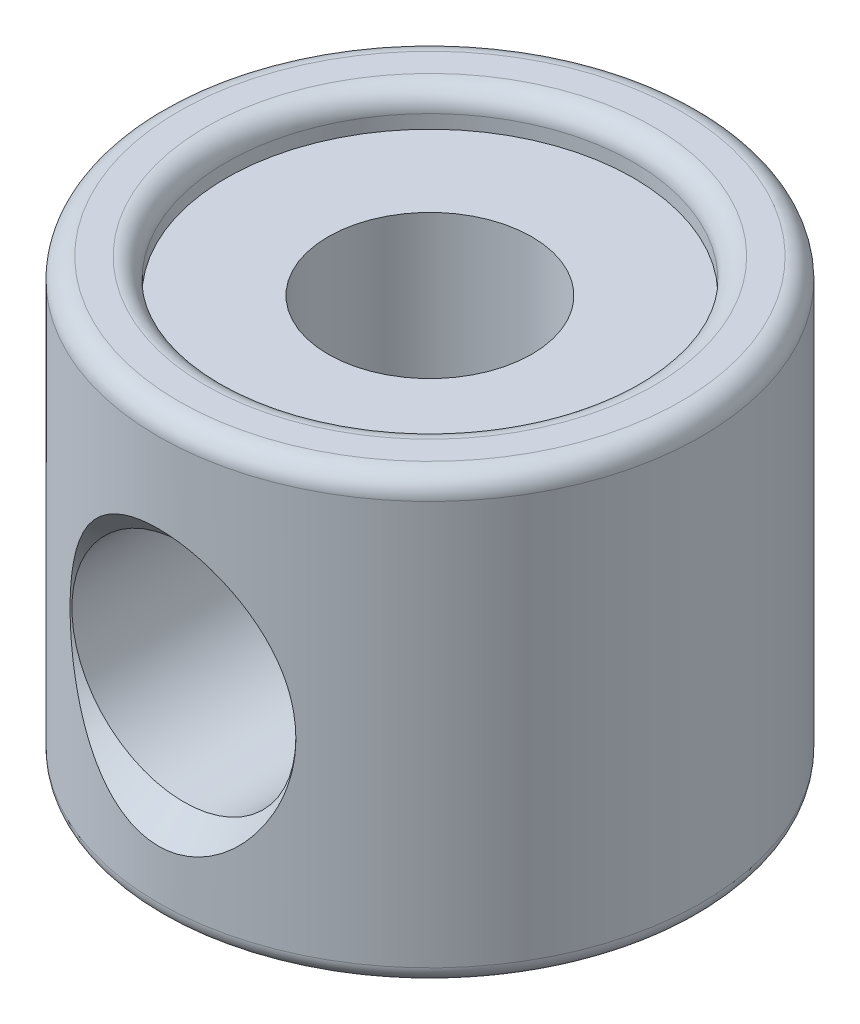
ISO-10303-21;
HEADER;
FILE_DESCRIPTION(('STEP AP214'),'2;1');
FILE_NAME('part.step','',(''),(''),'','','');
FILE_SCHEMA(('AUTOMOTIVE_DESIGN { 1 0 10303 214 1 1 1 1 }'));
ENDSEC;
DATA;
#1=APPLICATION_CONTEXT('core data for automotive mechanical design processes');
#2=APPLICATION_PROTOCOL_DEFINITION('international standard','automotive_design',2000,#1);
#3=PRODUCT_CONTEXT('',#1,'mechanical');
#4=PRODUCT('Part','Part','',(#3));
#5=PRODUCT_RELATED_PRODUCT_CATEGORY('part','',(#4));
#6=PRODUCT_DEFINITION_FORMATION('','',#4);
#7=PRODUCT_DEFINITION_CONTEXT('part definition',#1,'design');
#8=PRODUCT_DEFINITION('design','',#6,#7);
#9=PRODUCT_DEFINITION_SHAPE('','',#8);
#10=(LENGTH_UNIT() NAMED_UNIT(*) SI_UNIT(.MILLI.,.METRE.));
#11=(NAMED_UNIT(*) PLANE_ANGLE_UNIT() SI_UNIT($,.RADIAN.));
#12=(NAMED_UNIT(*) SI_UNIT($,.STERADIAN.) SOLID_ANGLE_UNIT());
#13=UNCERTAINTY_MEASURE_WITH_UNIT(LENGTH_MEASURE(1.E-05),#10,'distance_accuracy_value','');
#14=(GEOMETRIC_REPRESENTATION_CONTEXT(3) GLOBAL_UNCERTAINTY_ASSIGNED_CONTEXT((#13)) GLOBAL_UNIT_ASSIGNED_CONTEXT((#10,
#11,#12)) REPRESENTATION_CONTEXT('',''));
#15=CARTESIAN_POINT('',(0.,0.,0.));
#16=DIRECTION('',(0.,0.,1.));
#17=DIRECTION('',(1.,0.,0.));
#18=AXIS2_PLACEMENT_3D('',#15,#16,#17);
#19=CARTESIAN_POINT('',(0.,6.,0.));
#20=DIRECTION('',(0.,1.,0.));
#21=DIRECTION('',(0.,0.,1.));
#22=AXIS2_PLACEMENT_3D('',#19,#20,#21);
#23=PLANE('',#22);
#24=CARTESIAN_POINT('',(0.,6.,0.));
#25=DIRECTION('',(0.,1.,0.));
#26=DIRECTION('',(0.,0.,1.));
#27=AXIS2_PLACEMENT_3D('',#24,#25,#26);
#28=CIRCLE('',#27,3.);
#29=CARTESIAN_POINT('',(0.,6.,3.));
#30=VERTEX_POINT('',#29);
#31=EDGE_CURVE('E127',#30,#30,#28,.F.);
#32=ORIENTED_EDGE('',*,*,#31,.F.);
#33=EDGE_LOOP('',(#32));
#34=FACE_BOUND('',#33,.T.);
#35=CARTESIAN_POINT('',(0.,6.,0.));
#36=DIRECTION('',(0.,1.,0.));
#37=DIRECTION('',(0.,0.,1.));
#38=AXIS2_PLACEMENT_3D('',#35,#36,#37);
#39=CIRCLE('',#38,1.5);
#40=CARTESIAN_POINT('',(0.,6.,1.5));
#41=VERTEX_POINT('',#40);
#42=EDGE_CURVE('E124',#41,#41,#39,.T.);
#43=ORIENTED_EDGE('',*,*,#42,.F.);
#44=EDGE_LOOP('',(#43));
#45=FACE_BOUND('',#44,.T.);
#46=ADVANCED_FACE('F37',(#34,#45),#23,.T.);
#47=CARTESIAN_POINT('',(0.,0.,0.));
#48=DIRECTION('',(0.,1.,0.));
#49=DIRECTION('',(0.,0.,1.));
#50=AXIS2_PLACEMENT_3D('',#47,#48,#49);
#51=PLANE('',#50);
#52=CARTESIAN_POINT('',(0.,0.,0.));
#53=DIRECTION('',(0.,1.,0.));
#54=DIRECTION('',(0.,0.,1.));
#55=AXIS2_PLACEMENT_3D('',#52,#53,#54);
#56=CIRCLE('',#55,3.75);
#57=CARTESIAN_POINT('',(0.,0.,3.75));
#58=VERTEX_POINT('',#57);
#59=EDGE_CURVE('E147',#58,#58,#56,.F.);
#60=ORIENTED_EDGE('',*,*,#59,.T.);
#61=EDGE_LOOP('',(#60));
#62=FACE_BOUND('',#61,.T.);
#63=CARTESIAN_POINT('',(0.,0.,0.));
#64=DIRECTION('',(0.,1.,0.));
#65=DIRECTION('',(0.,0.,1.));
#66=AXIS2_PLACEMENT_3D('',#63,#64,#65);
#67=CIRCLE('',#66,1.5);
#68=CARTESIAN_POINT('',(0.,0.,1.5));
#69=VERTEX_POINT('',#68);
#70=EDGE_CURVE('E120',#69,#69,#67,.T.);
#71=ORIENTED_EDGE('',*,*,#70,.T.);
#72=EDGE_LOOP('',(#71));
#73=FACE_BOUND('',#72,.T.);
#74=ADVANCED_FACE('F211',(#62,#73),#51,.F.);
#75=CARTESIAN_POINT('',(0.,6.,0.));
#76=DIRECTION('',(0.,-1.,0.));
#77=DIRECTION('',(0.,0.,-1.));
#78=AXIS2_PLACEMENT_3D('',#75,#76,#77);
#79=CYLINDRICAL_SURFACE('',#78,4.);
#80=CARTESIAN_POINT('',(-3.80292461854292,1.65703907313221,-1.24006627015148));
#81=CARTESIAN_POINT('',(-3.78007682197471,1.75284666351831,-1.31014025996293));
#82=CARTESIAN_POINT('',(-3.7578683957417,1.8550980161643,-1.37172377179949));
#83=CARTESIAN_POINT('',(-3.71750218394734,2.06899180874529,-1.47763312418507));
#84=CARTESIAN_POINT('',(-3.69935036731366,2.18064775861589,-1.52193360483742));
#85=CARTESIAN_POINT('',(-3.6692534765663,2.41109974507974,-1.59313904112884));
#86=CARTESIAN_POINT('',(-3.65735469135459,2.52994196469266,-1.61991461417346));
#87=CARTESIAN_POINT('',(-3.64154347559882,2.77074881886751,-1.65515570066254));
#88=CARTESIAN_POINT('',(-3.63762560523062,2.89271126921636,-1.66363368605215));
#89=CARTESIAN_POINT('',(-3.63830620098663,3.13910772842173,-1.66214689955455));
#90=CARTESIAN_POINT('',(-3.64308781366893,3.26353905739778,-1.65178551316124));
#91=CARTESIAN_POINT('',(-3.6608543654958,3.50879476654761,-1.61202033730324));
#92=CARTESIAN_POINT('',(-3.67384492617653,3.62961661550079,-1.58260349820505));
#93=CARTESIAN_POINT('',(-3.70627049467078,3.8643028860006,-1.50509732353342));
#94=CARTESIAN_POINT('',(-3.72571070820223,3.97816159917534,-1.45699289924274));
#95=CARTESIAN_POINT('',(-3.76850237198717,4.19547038927905,-1.34243031766836));
#96=CARTESIAN_POINT('',(-3.7918517248511,4.29892600044355,-1.2759819901877));
#97=CARTESIAN_POINT('',(-3.83446634160024,4.47170139629326,-1.14053214557524));
#98=CARTESIAN_POINT('',(-3.85358589455503,4.54366874337985,-1.07485570568288));
#99=CARTESIAN_POINT('',(-3.89051012538928,4.6759877277157,-0.932375444771155));
#100=CARTESIAN_POINT('',(-3.90831674079867,4.73635670127251,-0.855588536776844));
#101=CARTESIAN_POINT('',(-3.93757990551175,4.83242219564076,-0.707150137276079));
#102=CARTESIAN_POINT('',(-3.94960107258511,4.87062249060812,-0.637235713809737));
#103=CARTESIAN_POINT('',(-3.97033826754357,4.93540660941309,-0.491728798158112));
#104=CARTESIAN_POINT('',(-3.97905644116255,4.96199797651074,-0.416140030592249));
#105=CARTESIAN_POINT('',(-3.99226588050882,5.00196630982444,-0.260632117864861));
#106=CARTESIAN_POINT('',(-3.99673065410465,5.01526048025115,-0.180689069003356));
#107=CARTESIAN_POINT('',(-4.00076183836538,5.02727358135918,-0.019595338169757));
#108=CARTESIAN_POINT('',(-4.00033025087882,5.02599846860503,0.0615548367246155));
#109=CARTESIAN_POINT('',(-3.99493042487076,5.00988181412271,0.213890237580902));
#110=CARTESIAN_POINT('',(-3.99043008606359,4.99643932074304,0.285246644013292));
#111=CARTESIAN_POINT('',(-3.97800405646429,4.95877946467172,0.424723297701747));
#112=CARTESIAN_POINT('',(-3.97007771284258,4.93456004839774,0.492842925438296));
#113=CARTESIAN_POINT('',(-3.95111661134262,4.87538808576134,0.627286134881378));
#114=CARTESIAN_POINT('',(-3.93996357998497,4.84002140725628,0.693408835441682));
#115=CARTESIAN_POINT('',(-3.91563344402864,4.76054698073144,0.819732071142916));
#116=CARTESIAN_POINT('',(-3.90245545335639,4.71643540369051,0.879929994734706));
#117=CARTESIAN_POINT('',(-3.87254907130406,4.61244032502994,1.00405885458141));
#118=CARTESIAN_POINT('',(-3.85560578720164,4.55114708625103,1.06675400318925));
#119=CARTESIAN_POINT('',(-3.82155136096977,4.42045892601695,1.18297000892563));
#120=CARTESIAN_POINT('',(-3.80444010433491,4.35105806707585,1.23648407073424));
#121=CARTESIAN_POINT('',(-3.76774022616794,4.19026330848791,1.34464137549912));
#122=CARTESIAN_POINT('',(-3.74840083775621,4.09733446969822,1.39709459265923));
#123=CARTESIAN_POINT('',(-3.71318779687832,3.90430478159975,1.48816017221117));
#124=CARTESIAN_POINT('',(-3.69731621513677,3.80419969427121,1.52676427369043));
#125=CARTESIAN_POINT('',(-3.6688363559123,3.58521504768224,1.59410452714075));
#126=CARTESIAN_POINT('',(-3.65694880669003,3.46561554470451,1.62082935251101));
#127=CARTESIAN_POINT('',(-3.6412680444263,3.22324241547732,1.65575893309659));
#128=CARTESIAN_POINT('',(-3.63747414672328,3.10046905860119,1.6639652548403));
#129=CARTESIAN_POINT('',(-3.63851085259173,2.85330305071198,1.661698946295));
#130=CARTESIAN_POINT('',(-3.64347000836463,2.72891334455005,1.65094789984504));
#131=CARTESIAN_POINT('',(-3.66156406059565,2.48382787843758,1.61041335585132));
#132=CARTESIAN_POINT('',(-3.67470343584648,2.36313418011308,1.58061943180868));
#133=CARTESIAN_POINT('',(-3.70738492840576,2.12873478081395,1.50236149080882));
#134=CARTESIAN_POINT('',(-3.72693402762848,2.01503686124049,1.45387710474338));
#135=CARTESIAN_POINT('',(-3.76988732883114,1.79812245823933,1.33855366139478));
#136=CARTESIAN_POINT('',(-3.79328947119175,1.69490042238853,1.27172439758157));
#137=CARTESIAN_POINT('',(-3.83588067268954,1.52285768970425,1.13577210998344));
#138=CARTESIAN_POINT('',(-3.85493535903416,1.45134457294275,1.07000780345962));
#139=CARTESIAN_POINT('',(-3.89169331678061,1.31993351897751,0.927426605261265));
#140=CARTESIAN_POINT('',(-3.9093985865837,1.26001819523791,0.85062656347281));
#141=CARTESIAN_POINT('',(-3.93847113146569,1.16471631444592,0.702172414434151));
#142=CARTESIAN_POINT('',(-3.95040457011351,1.12683878245213,0.632233656826195));
#143=CARTESIAN_POINT('',(-3.97095366825139,1.06270158746756,0.48673179395772));
#144=CARTESIAN_POINT('',(-3.97957147456721,1.03643440529122,0.411172365957502));
#145=CARTESIAN_POINT('',(-3.99257752552084,0.997100878050362,0.255791212620956));
#146=CARTESIAN_POINT('',(-3.99693957331553,0.984116272088799,0.175946240410958));
#147=CARTESIAN_POINT('',(-4.00077871607039,0.972676933491466,0.0151091808310579));
#148=CARTESIAN_POINT('',(-4.00025779652656,0.974216295169752,-0.0658824269227249));
#149=CARTESIAN_POINT('',(-3.99470851215693,0.990781705035694,-0.217975236282474));
#150=CARTESIAN_POINT('',(-3.99014035032852,1.00443098031027,-0.289249682005385));
#151=CARTESIAN_POINT('',(-3.9775931580728,1.04247405446644,-0.428540497313201));
#152=CARTESIAN_POINT('',(-3.96961323384192,1.06687066895553,-0.496556007935591));
#153=CARTESIAN_POINT('',(-3.95054367540246,1.1264204665072,-0.630885278392609));
#154=CARTESIAN_POINT('',(-3.93933156861198,1.16200362168771,-0.696988969100382));
#155=CARTESIAN_POINT('',(-3.91489820479606,1.24189634409687,-0.823232945267392));
#156=CARTESIAN_POINT('',(-3.90167664991789,1.28620720528832,-0.883372344475265));
#157=CARTESIAN_POINT('',(-3.87427630450026,1.38162224128376,-0.996669124131797));
#158=CARTESIAN_POINT('',(-3.86010812184812,1.43265585576688,-1.04988894812992));
#159=CARTESIAN_POINT('',(-3.83151955690726,1.54064395443738,-1.14985277623359));
#160=CARTESIAN_POINT('',(-3.81709904809413,1.59760148420129,-1.19659342019902));
#161=CARTESIAN_POINT('',(-3.80292461854292,1.65703907313221,-1.24006627015148));
#162=B_SPLINE_CURVE_WITH_KNOTS('',3,(#80,#81,#82,#83,#84,#85,#86,#87,#88,#89,#90,#91,#92,#93,
#94,#95,#96,#97,#98,#99,#100,#101,#102,#103,#104,#105,#106,#107,#108,#109,#110,#111,#112,#113,
#114,#115,#116,#117,#118,#119,#120,#121,#122,#123,#124,#125,#126,#127,#128,#129,#130,#131,#132,
#133,#134,#135,#136,#137,#138,#139,#140,#141,#142,#143,#144,#145,#146,#147,#148,#149,#150,#151,
#152,#153,#154,#155,#156,#157,#158,#159,#160,#161),.UNSPECIFIED.,.T.,.F.,(4,2,2,2,2,2,2,2,2,2,2,
2,2,2,2,2,2,2,2,2,2,2,2,2,2,2,2,2,2,2,2,2,2,2,2,2,2,2,2,2,4),(0.,0.362356925661135,
0.725243566235169,1.09077997296756,1.45606714511237,1.82913371792588,2.2024560462088,
2.57608043074705,2.94950499145882,3.24626251975812,3.5425729679072,3.78331996111719,
4.02391028783943,4.26598950932176,4.50796976170095,4.72523291594355,4.94253748822069,
5.16912062735338,5.39580319765903,5.66274487806351,5.92988328910098,6.25395498993915,
6.57821967739997,6.94586917148129,7.31348756396972,7.68655001452741,8.05981690221505,
8.43349173630248,8.80696746958503,9.10288054069357,9.39834650603375,9.63866046601264,
9.87881856313217,10.1204458267712,10.361974844996,10.579128433507,10.7963389461748,
11.023205617917,11.250105950085,11.474790649651,11.6995914395145),.UNSPECIFIED.);
#163=CARTESIAN_POINT('',(-3.80292461854292,1.65703907313221,-1.24006627015148));
#164=VERTEX_POINT('',#163);
#165=EDGE_CURVE('E11',#164,#164,#162,.T.);
#166=ORIENTED_EDGE('',*,*,#165,.T.);
#167=EDGE_LOOP('',(#166));
#168=FACE_BOUND('',#167,.T.);
#169=CARTESIAN_POINT('',(-1.24006627015147,1.65703907313221,3.80292461854293));
#170=CARTESIAN_POINT('',(-1.31014025996291,1.75284666351831,3.78007682197471));
#171=CARTESIAN_POINT('',(-1.37172377179948,1.8550980161643,3.7578683957417));
#172=CARTESIAN_POINT('',(-1.47763312418506,2.06899180874529,3.71750218394734));
#173=CARTESIAN_POINT('',(-1.5219336048374,2.18064775861589,3.69935036731367));
#174=CARTESIAN_POINT('',(-1.59313904112883,2.41109974507975,3.6692534765663));
#175=CARTESIAN_POINT('',(-1.61991461417345,2.52994196469266,3.65735469135459));
#176=CARTESIAN_POINT('',(-1.65515570066253,2.77074881886751,3.64154347559883));
#177=CARTESIAN_POINT('',(-1.66363368605214,2.89271126921636,3.63762560523062));
#178=CARTESIAN_POINT('',(-1.66214689955454,3.13910772842173,3.63830620098663));
#179=CARTESIAN_POINT('',(-1.65178551316123,3.26353905739778,3.64308781366894));
#180=CARTESIAN_POINT('',(-1.61202033730323,3.50879476654761,3.6608543654958));
#181=CARTESIAN_POINT('',(-1.58260349820504,3.62961661550079,3.67384492617654));
#182=CARTESIAN_POINT('',(-1.5050973235334,3.8643028860006,3.70627049467078));
#183=CARTESIAN_POINT('',(-1.45699289924273,3.97816159917534,3.72571070820224));
#184=CARTESIAN_POINT('',(-1.34243031766834,4.19547038927905,3.76850237198718));
#185=CARTESIAN_POINT('',(-1.27598199018769,4.29892600044355,3.79185172485111));
#186=CARTESIAN_POINT('',(-1.14053214557523,4.47170139629326,3.83446634160024));
#187=CARTESIAN_POINT('',(-1.07485570568286,4.54366874337985,3.85358589455503));
#188=CARTESIAN_POINT('',(-0.93237544477114,4.6759877277157,3.89051012538928));
#189=CARTESIAN_POINT('',(-0.855588536776829,4.73635670127252,3.90831674079867));
#190=CARTESIAN_POINT('',(-0.707150137276063,4.83242219564076,3.93757990551176));
#191=CARTESIAN_POINT('',(-0.63723571380972,4.87062249060813,3.94960107258511));
#192=CARTESIAN_POINT('',(-0.491728798158095,4.93540660941309,3.97033826754358));
#193=CARTESIAN_POINT('',(-0.416140030592233,4.96199797651074,3.97905644116255));
#194=CARTESIAN_POINT('',(-0.260632117864845,5.00196630982444,3.99226588050882));
#195=CARTESIAN_POINT('',(-0.180689069003339,5.01526048025115,3.99673065410465));
#196=CARTESIAN_POINT('',(-0.0195953381697399,5.02727358135918,4.00076183836538));
#197=CARTESIAN_POINT('',(0.0615548367246325,5.02599846860503,4.00033025087882));
#198=CARTESIAN_POINT('',(0.213890237580919,5.00988181412271,3.99493042487076));
#199=CARTESIAN_POINT('',(0.285246644013309,4.99643932074304,3.99043008606359));
#200=CARTESIAN_POINT('',(0.424723297701764,4.95877946467172,3.97800405646429));
#201=CARTESIAN_POINT('',(0.492842925438312,4.93456004839774,3.97007771284258));
#202=CARTESIAN_POINT('',(0.627286134881394,4.87538808576134,3.95111661134262));
#203=CARTESIAN_POINT('',(0.693408835441699,4.84002140725628,3.93996357998497));
#204=CARTESIAN_POINT('',(0.819732071142933,4.76054698073143,3.91563344402864));
#205=CARTESIAN_POINT('',(0.879929994734722,4.71643540369051,3.90245545335639));
#206=CARTESIAN_POINT('',(1.00405885458143,4.61244032502994,3.87254907130405));
#207=CARTESIAN_POINT('',(1.06675400318927,4.55114708625103,3.85560578720163));
#208=CARTESIAN_POINT('',(1.18297000892565,4.42045892601695,3.82155136096977));
#209=CARTESIAN_POINT('',(1.23648407073425,4.35105806707585,3.80444010433491));
#210=CARTESIAN_POINT('',(1.34464137549913,4.1902633084879,3.76774022616793));
#211=CARTESIAN_POINT('',(1.39709459265925,4.09733446969822,3.7484008377562));
#212=CARTESIAN_POINT('',(1.48816017221119,3.90430478159974,3.71318779687831));
#213=CARTESIAN_POINT('',(1.52676427369044,3.8041996942712,3.69731621513677));
#214=CARTESIAN_POINT('',(1.59410452714076,3.58521504768223,3.66883635591229));
#215=CARTESIAN_POINT('',(1.62082935251102,3.4656155447045,3.65694880669003));
#216=CARTESIAN_POINT('',(1.65575893309661,3.22324241547732,3.64126804442629));
#217=CARTESIAN_POINT('',(1.66396525484032,3.10046905860118,3.63747414672328));
#218=CARTESIAN_POINT('',(1.66169894629502,2.85330305071197,3.63851085259172));
#219=CARTESIAN_POINT('',(1.65094789984505,2.72891334455004,3.64347000836462));
#220=CARTESIAN_POINT('',(1.61041335585133,2.48382787843758,3.66156406059565));
#221=CARTESIAN_POINT('',(1.58061943180869,2.36313418011307,3.67470343584648));
#222=CARTESIAN_POINT('',(1.50236149080883,2.12873478081394,3.70738492840576));
#223=CARTESIAN_POINT('',(1.4538771047434,2.01503686124049,3.72693402762847));
#224=CARTESIAN_POINT('',(1.33855366139479,1.79812245823933,3.76988732883114));
#225=CARTESIAN_POINT('',(1.27172439758158,1.69490042238853,3.79328947119174));
#226=CARTESIAN_POINT('',(1.13577210998345,1.52285768970424,3.83588067268953));
#227=CARTESIAN_POINT('',(1.07000780345963,1.45134457294275,3.85493535903416));
#228=CARTESIAN_POINT('',(0.927426605261274,1.3199335189775,3.89169331678061));
#229=CARTESIAN_POINT('',(0.85062656347282,1.26001819523791,3.9093985865837));
#230=CARTESIAN_POINT('',(0.702172414434161,1.16471631444591,3.93847113146569));
#231=CARTESIAN_POINT('',(0.632233656826205,1.12683878245212,3.95040457011351));
#232=CARTESIAN_POINT('',(0.486731793957729,1.06270158746756,3.97095366825139));
#233=CARTESIAN_POINT('',(0.411172365957511,1.03643440529122,3.97957147456721));
#234=CARTESIAN_POINT('',(0.255791212620967,0.997100878050361,3.99257752552084));
#235=CARTESIAN_POINT('',(0.175946240410969,0.984116272088798,3.99693957331553));
#236=CARTESIAN_POINT('',(0.0151091808310694,0.972676933491465,4.00077871607039));
#237=CARTESIAN_POINT('',(-0.0658824269227136,0.974216295169751,4.00025779652656));
#238=CARTESIAN_POINT('',(-0.217975236282463,0.990781705035694,3.99470851215693));
#239=CARTESIAN_POINT('',(-0.289249682005374,1.00443098031027,3.99014035032852));
#240=CARTESIAN_POINT('',(-0.428540497313189,1.04247405446644,3.9775931580728));
#241=CARTESIAN_POINT('',(-0.49655600793558,1.06687066895553,3.96961323384192));
#242=CARTESIAN_POINT('',(-0.630885278392598,1.1264204665072,3.95054367540246));
#243=CARTESIAN_POINT('',(-0.69698896910037,1.16200362168772,3.93933156861198));
#244=CARTESIAN_POINT('',(-0.82323294526738,1.24189634409687,3.91489820479606));
#245=CARTESIAN_POINT('',(-0.883372344475254,1.28620720528833,3.90167664991789));
#246=CARTESIAN_POINT('',(-0.996669124131786,1.38162224128376,3.87427630450026));
#247=CARTESIAN_POINT('',(-1.04988894812991,1.43265585576688,3.86010812184812));
#248=CARTESIAN_POINT('',(-1.14985277623358,1.54064395443738,3.83151955690727));
#249=CARTESIAN_POINT('',(-1.19659342019901,1.59760148420129,3.81709904809413));
#250=CARTESIAN_POINT('',(-1.24006627015147,1.65703907313221,3.80292461854293));
#251=B_SPLINE_CURVE_WITH_KNOTS('',3,(#169,#170,#171,#172,#173,#174,#175,#176,#177,#178,#179,
#180,#181,#182,#183,#184,#185,#186,#187,#188,#189,#190,#191,#192,#193,#194,#195,#196,#197,#198,
#199,#200,#201,#202,#203,#204,#205,#206,#207,#208,#209,#210,#211,#212,#213,#214,#215,#216,#217,
#218,#219,#220,#221,#222,#223,#224,#225,#226,#227,#228,#229,#230,#231,#232,#233,#234,#235,#236,
#237,#238,#239,#240,#241,#242,#243,#244,#245,#246,#247,#248,#249,#250),.UNSPECIFIED.,.T.,.F.,(4,
2,2,2,2,2,2,2,2,2,2,2,2,2,2,2,2,2,2,2,2,2,2,2,2,2,2,2,2,2,2,2,2,2,2,2,2,2,2,2,4),(0.,
0.362356925661136,0.725243566235169,1.09077997296756,1.45606714511237,1.82913371792588,
2.2024560462088,2.57608043074705,2.94950499145882,3.24626251975812,3.54257296790721,
3.78331996111719,4.02391028783943,4.26598950932176,4.50796976170095,4.72523291594355,
4.94253748822069,5.16912062735338,5.39580319765903,5.66274487806351,5.92988328910098,
6.25395498993915,6.57821967739997,6.9458691714813,7.31348756396973,7.68655001452741,
8.05981690221505,8.43349173630248,8.80696746958504,9.10288054069357,9.39834650603376,
9.63866046601265,9.87881856313217,10.1204458267712,10.361974844996,10.579128433507,
10.7963389461748,11.023205617917,11.250105950085,11.474790649651,11.6995914395145),.UNSPECIFIED.);
#252=CARTESIAN_POINT('',(-1.24006627015147,1.65703907313221,3.80292461854293));
#253=VERTEX_POINT('',#252);
#254=EDGE_CURVE('E174',#253,#253,#251,.T.);
#255=ORIENTED_EDGE('',*,*,#254,.T.);
#256=EDGE_LOOP('',(#255));
#257=FACE_BOUND('',#256,.T.);
#258=CARTESIAN_POINT('',(0.,0.25,0.));
#259=DIRECTION('',(0.,1.,0.));
#260=DIRECTION('',(0.,0.,1.));
#261=AXIS2_PLACEMENT_3D('',#258,#259,#260);
#262=CIRCLE('',#261,4.);
#263=CARTESIAN_POINT('',(0.,0.25,4.));
#264=VERTEX_POINT('',#263);
#265=EDGE_CURVE('E144',#264,#264,#262,.T.);
#266=ORIENTED_EDGE('',*,*,#265,.T.);
#267=EDGE_LOOP('',(#266));
#268=FACE_BOUND('',#267,.T.);
#269=CARTESIAN_POINT('',(0.,6.2,0.));
#270=DIRECTION('',(0.,1.,0.));
#271=DIRECTION('',(0.,0.,1.));
#272=AXIS2_PLACEMENT_3D('',#269,#270,#271);
#273=CIRCLE('',#272,4.);
#274=CARTESIAN_POINT('',(0.,6.2,4.));
#275=VERTEX_POINT('',#274);
#276=EDGE_CURVE('E141',#275,#275,#273,.F.);
#277=ORIENTED_EDGE('',*,*,#276,.T.);
#278=EDGE_LOOP('',(#277));
#279=FACE_BOUND('',#278,.T.);
#280=ADVANCED_FACE('F163',(#168,#257,#268,#279),#79,.T.);
#281=CARTESIAN_POINT('',(0.,6.,0.));
#282=DIRECTION('',(0.,-1.,0.));
#283=DIRECTION('',(0.,0.,-1.));
#284=AXIS2_PLACEMENT_3D('',#281,#282,#283);
#285=CYLINDRICAL_SURFACE('',#284,1.5);
#286=CARTESIAN_POINT('',(-1.5,3.68738635424336,0.));
#287=CARTESIAN_POINT('',(-1.50000447406715,3.68736667555055,0.0221484449998914));
#288=CARTESIAN_POINT('',(-1.49950927634109,3.68845783657938,0.044276134141359));
#289=CARTESIAN_POINT('',(-1.49756294449903,3.69268592309484,0.0882309407560374));
#290=CARTESIAN_POINT('',(-1.49611456325326,3.69581695700504,0.110058739556769));
#291=CARTESIAN_POINT('',(-1.49047328028752,3.70786105987617,0.174065145863211));
#292=CARTESIAN_POINT('',(-1.48498052511108,3.71943896893514,0.215631523118339));
#293=CARTESIAN_POINT('',(-1.46744293306414,3.7547546659834,0.316953438714507));
#294=CARTESIAN_POINT('',(-1.45348605708138,3.78168225412286,0.375195737109225));
#295=CARTESIAN_POINT('',(-1.41979888355067,3.84135011584657,0.487494349877064));
#296=CARTESIAN_POINT('',(-1.40000270816456,3.87415493945665,0.541493471462897));
#297=CARTESIAN_POINT('',(-1.35783883670072,3.9381177934533,0.639336298720913));
#298=CARTESIAN_POINT('',(-1.33606556934905,3.96900038503546,0.683620767198729));
#299=CARTESIAN_POINT('',(-1.28850839632405,4.03140245086512,0.769517732585914));
#300=CARTESIAN_POINT('',(-1.26272187201678,4.06292232917219,0.811128459664329));
#301=CARTESIAN_POINT('',(-1.17948671828247,4.15683575303895,0.931855501150151));
#302=CARTESIAN_POINT('',(-1.11598629807275,4.21886856717084,1.00727266753873));
#303=CARTESIAN_POINT('',(-0.990098916855102,4.32178319800016,1.12931924692285));
#304=CARTESIAN_POINT('',(-0.931303964781118,4.36410696518007,1.17846008304906));
#305=CARTESIAN_POINT('',(-0.804150695646665,4.44270567343806,1.26861923064038));
#306=CARTESIAN_POINT('',(-0.735805408924681,4.47898871101305,1.30964842834388));
#307=CARTESIAN_POINT('',(-0.604688012192463,4.53652554955183,1.37425523156209));
#308=CARTESIAN_POINT('',(-0.543514926662853,4.55933336587964,1.39968098658133));
#309=CARTESIAN_POINT('',(-0.416346887973421,4.59798595778391,1.44261831335075));
#310=CARTESIAN_POINT('',(-0.350355158091534,4.6138353391095,1.46013512020818));
#311=CARTESIAN_POINT('',(-0.214726616012652,4.63742329587385,1.4861647140112));
#312=CARTESIAN_POINT('',(-0.14506946923284,4.64511017436952,1.494620113907));
#313=CARTESIAN_POINT('',(-0.00485236427368114,4.65148252854544,1.50163145239621));
#314=CARTESIAN_POINT('',(0.0657072514139792,4.65017132346821,1.50019104138851));
#315=CARTESIAN_POINT('',(0.19805585654478,4.63927808616107,1.48819943697544));
#316=CARTESIAN_POINT('',(0.260006547660196,4.63055149319627,1.47859051716962));
#317=CARTESIAN_POINT('',(0.381012828513424,4.60659140763456,1.45212512243361));
#318=CARTESIAN_POINT('',(0.440067859663007,4.5913566650431,1.43526725522268));
#319=CARTESIAN_POINT('',(0.556985503150736,4.55441727854244,1.39420159043157));
#320=CARTESIAN_POINT('',(0.614642568564463,4.53242842249822,1.36966981058903));
#321=CARTESIAN_POINT('',(0.724782673881043,4.48351919413636,1.31471839277816));
#322=CARTESIAN_POINT('',(0.77726359365904,4.45659681386781,1.28429635718163));
#323=CARTESIAN_POINT('',(0.902985502421482,4.3837682243647,1.20121185017075));
#324=CARTESIAN_POINT('',(0.972607311476638,4.33533038817184,1.1452732795972));
#325=CARTESIAN_POINT('',(1.09923918777515,4.23322023416077,1.02439312474697));
#326=CARTESIAN_POINT('',(1.1562062400392,4.17953093031201,0.959422018494181));
#327=CARTESIAN_POINT('',(1.25906875302783,4.06912369000769,0.82003070832801));
#328=CARTESIAN_POINT('',(1.30466286148348,4.01236390145752,0.74541985968591));
#329=CARTESIAN_POINT('',(1.36338214886628,3.92996697828838,0.626989417453357));
#330=CARTESIAN_POINT('',(1.38133684919242,3.90297098887717,0.586448311247498));
#331=CARTESIAN_POINT('',(1.41392509255887,3.85102749907501,0.502822395260103));
#332=CARTESIAN_POINT('',(1.42856276901354,3.82607747419438,0.459740836545144));
#333=CARTESIAN_POINT('',(1.45293241521923,3.78233561312037,0.375129278238253));
#334=CARTESIAN_POINT('',(1.46301415456402,3.76317430090238,0.333895642009354));
#335=CARTESIAN_POINT('',(1.47982745388688,3.73003809384319,0.248928057972144));
#336=CARTESIAN_POINT('',(1.48658072104477,3.71602974940122,0.205212441634936));
#337=CARTESIAN_POINT('',(1.49420358558965,3.69993003288424,0.134320181687055));
#338=CARTESIAN_POINT('',(1.49635252195317,3.69530502795805,0.107861991820306));
#339=CARTESIAN_POINT('',(1.49926218434104,3.68899710293431,0.0542883536749715));
#340=CARTESIAN_POINT('',(1.50001034175023,3.6873408255988,0.0271691459158379));
#341=CARTESIAN_POINT('',(1.5,3.68738635424336,0.));
#342=B_SPLINE_CURVE_WITH_KNOTS('',3,(#286,#287,#288,#289,#290,#291,#292,#293,#294,#295,#296,
#297,#298,#299,#300,#301,#302,#303,#304,#305,#306,#307,#308,#309,#310,#311,#312,#313,#314,#315,
#316,#317,#318,#319,#320,#321,#322,#323,#324,#325,#326,#327,#328,#329,#330,#331,#332,#333,#334,
#335,#336,#337,#338,#339,#340,#341),.UNSPECIFIED.,.F.,.F.,(4,2,2,2,2,2,2,2,2,2,2,2,2,2,2,2,2,2,
2,2,2,2,2,2,2,2,2,4),(0.,0.0663780026565318,0.132565136709905,0.26239156828519,
0.458312912660752,0.656535147557369,0.830949570164956,1.00547827832983,1.35297301132437,
1.61471771431488,1.87610872160455,2.08546425100029,2.29468099946102,2.50521505325032,
2.71567144872451,2.90470632319764,3.0937775211868,3.29225659457519,3.49081662935398,
3.7939273115488,4.09805305096362,4.40953989932393,4.56513131068288,4.7205277568222,
4.85993701945224,4.99842465742859,5.07906895311344,5.16043343232563),.UNSPECIFIED.);
#343=CARTESIAN_POINT('',(-1.50000000000001,3.68738635424336,0.));
#344=VERTEX_POINT('',#343);
#345=CARTESIAN_POINT('',(1.50000000000001,3.68738635424336,0.));
#346=VERTEX_POINT('',#345);
#347=EDGE_CURVE('E169',#344,#346,#342,.T.);
#348=ORIENTED_EDGE('',*,*,#347,.F.);
#349=DIRECTION('',(0.,-1.,0.));
#350=VECTOR('',#349,1.);
#351=CARTESIAN_POINT('',(-1.5,6.,0.));
#352=LINE('',#351,#350);
#353=CARTESIAN_POINT('',(-1.50000000000001,2.31261364575664,0.));
#354=VERTEX_POINT('',#353);
#355=EDGE_CURVE('E155',#354,#344,#352,.F.);
#356=ORIENTED_EDGE('',*,*,#355,.F.);
#357=CARTESIAN_POINT('',(1.5,2.31261364575664,0.));
#358=CARTESIAN_POINT('',(1.50000447406715,2.31263332444945,0.0221484449998914));
#359=CARTESIAN_POINT('',(1.49950927634109,2.31154216342062,0.044276134141359));
#360=CARTESIAN_POINT('',(1.49756294449903,2.30731407690516,0.0882309407560375));
#361=CARTESIAN_POINT('',(1.49611456325326,2.30418304299496,0.110058739556769));
#362=CARTESIAN_POINT('',(1.49047328028752,2.29213894012383,0.174065145863211));
#363=CARTESIAN_POINT('',(1.48498052511108,2.28056103106486,0.215631523118339));
#364=CARTESIAN_POINT('',(1.46744293306414,2.2452453340166,0.316953438714506));
#365=CARTESIAN_POINT('',(1.45348605708138,2.21831774587714,0.375195737109225));
#366=CARTESIAN_POINT('',(1.41979888355067,2.15864988415343,0.487494349877064));
#367=CARTESIAN_POINT('',(1.40000270816456,2.12584506054335,0.541493471462896));
#368=CARTESIAN_POINT('',(1.35783883670072,2.0618822065467,0.639336298720913));
#369=CARTESIAN_POINT('',(1.33606556934905,2.03099961496454,0.683620767198729));
#370=CARTESIAN_POINT('',(1.28850839632405,1.96859754913488,0.769517732585914));
#371=CARTESIAN_POINT('',(1.26272187201679,1.93707767082781,0.811128459664328));
#372=CARTESIAN_POINT('',(1.17948671828247,1.84316424696105,0.931855501150151));
#373=CARTESIAN_POINT('',(1.11598629807276,1.78113143282916,1.00727266753873));
#374=CARTESIAN_POINT('',(0.990098916855102,1.67821680199984,1.12931924692285));
#375=CARTESIAN_POINT('',(0.931303964781118,1.63589303481993,1.17846008304906));
#376=CARTESIAN_POINT('',(0.804150695646666,1.55729432656194,1.26861923064038));
#377=CARTESIAN_POINT('',(0.735805408924682,1.52101128898695,1.30964842834388));
#378=CARTESIAN_POINT('',(0.604688012192464,1.46347445044817,1.37425523156209));
#379=CARTESIAN_POINT('',(0.543514926662854,1.44066663412036,1.39968098658133));
#380=CARTESIAN_POINT('',(0.416346887973422,1.40201404221609,1.44261831335075));
#381=CARTESIAN_POINT('',(0.350355158091534,1.3861646608905,1.46013512020818));
#382=CARTESIAN_POINT('',(0.214726616012652,1.36257670412615,1.4861647140112));
#383=CARTESIAN_POINT('',(0.14506946923284,1.35488982563048,1.494620113907));
#384=CARTESIAN_POINT('',(0.0048523642736811,1.34851747145456,1.5016314523962));
#385=CARTESIAN_POINT('',(-0.0657072514139792,1.34982867653179,1.50019104138851));
#386=CARTESIAN_POINT('',(-0.19805585654478,1.36072191383893,1.48819943697544));
#387=CARTESIAN_POINT('',(-0.260006547660196,1.36944850680373,1.47859051716962));
#388=CARTESIAN_POINT('',(-0.381012828513424,1.39340859236544,1.45212512243361));
#389=CARTESIAN_POINT('',(-0.440067859663007,1.4086433349569,1.43526725522268));
#390=CARTESIAN_POINT('',(-0.556985503150735,1.44558272145756,1.39420159043157));
#391=CARTESIAN_POINT('',(-0.614642568564463,1.46757157750178,1.36966981058903));
#392=CARTESIAN_POINT('',(-0.724782673881043,1.51648080586364,1.31471839277816));
#393=CARTESIAN_POINT('',(-0.77726359365904,1.54340318613219,1.28429635718163));
#394=CARTESIAN_POINT('',(-0.902985502421483,1.6162317756353,1.20121185017075));
#395=CARTESIAN_POINT('',(-0.972607311476638,1.66466961182816,1.1452732795972));
#396=CARTESIAN_POINT('',(-1.09923918777515,1.76677976583923,1.02439312474697));
#397=CARTESIAN_POINT('',(-1.1562062400392,1.82046906968799,0.959422018494181));
#398=CARTESIAN_POINT('',(-1.25906875302783,1.93087630999232,0.820030708328009));
#399=CARTESIAN_POINT('',(-1.30466286148348,1.98763609854248,0.74541985968591));
#400=CARTESIAN_POINT('',(-1.36338214886628,2.07003302171162,0.626989417453356));
#401=CARTESIAN_POINT('',(-1.38133684919242,2.09702901112283,0.586448311247498));
#402=CARTESIAN_POINT('',(-1.41392509255887,2.14897250092499,0.502822395260103));
#403=CARTESIAN_POINT('',(-1.42856276901354,2.17392252580562,0.459740836545144));
#404=CARTESIAN_POINT('',(-1.45293241521923,2.21766438687963,0.375129278238252));
#405=CARTESIAN_POINT('',(-1.46301415456402,2.23682569909762,0.333895642009354));
#406=CARTESIAN_POINT('',(-1.47982745388688,2.26996190615681,0.248928057972144));
#407=CARTESIAN_POINT('',(-1.48658072104477,2.28397025059878,0.205212441634936));
#408=CARTESIAN_POINT('',(-1.49420358558965,2.30006996711576,0.134320181687055));
#409=CARTESIAN_POINT('',(-1.49635252195317,2.30469497204195,0.107861991820306));
#410=CARTESIAN_POINT('',(-1.49926218434104,2.31100289706569,0.0542883536749714));
#411=CARTESIAN_POINT('',(-1.50001034175023,2.3126591744012,0.0271691459158378));
#412=CARTESIAN_POINT('',(-1.5,2.31261364575664,0.));
#413=B_SPLINE_CURVE_WITH_KNOTS('',3,(#357,#358,#359,#360,#361,#362,#363,#364,#365,#366,#367,
#368,#369,#370,#371,#372,#373,#374,#375,#376,#377,#378,#379,#380,#381,#382,#383,#384,#385,#386,
#387,#388,#389,#390,#391,#392,#393,#394,#395,#396,#397,#398,#399,#400,#401,#402,#403,#404,#405,
#406,#407,#408,#409,#410,#411,#412),.UNSPECIFIED.,.F.,.F.,(4,2,2,2,2,2,2,2,2,2,2,2,2,2,2,2,2,2,
2,2,2,2,2,2,2,2,2,4),(0.,0.0663780026565318,0.132565136709905,0.26239156828519,
0.458312912660752,0.656535147557369,0.830949570164956,1.00547827832983,1.35297301132437,
1.61471771431488,1.87610872160455,2.08546425100029,2.29468099946102,2.50521505325032,
2.71567144872451,2.90470632319764,3.0937775211868,3.29225659457519,3.49081662935398,
3.7939273115488,4.09805305096362,4.40953989932393,4.56513131068288,4.7205277568222,
4.85993701945224,4.99842465742859,5.07906895311344,5.16043343232563),.UNSPECIFIED.);
#414=CARTESIAN_POINT('',(1.5,2.31261364575664,0.));
#415=VERTEX_POINT('',#414);
#416=EDGE_CURVE('E112',#415,#354,#413,.T.);
#417=ORIENTED_EDGE('',*,*,#416,.F.);
#418=DIRECTION('',(0.,-1.,0.));
#419=VECTOR('',#418,1.);
#420=CARTESIAN_POINT('',(1.5,6.,0.));
#421=LINE('',#420,#419);
#422=EDGE_CURVE('E175',#346,#415,#421,.T.);
#423=ORIENTED_EDGE('',*,*,#422,.F.);
#424=EDGE_LOOP('',(#348,#356,#417,#423));
#425=FACE_BOUND('',#424,.T.);
#426=ORIENTED_EDGE('',*,*,#42,.T.);
#427=EDGE_LOOP('',(#426));
#428=FACE_BOUND('',#427,.T.);
#429=ORIENTED_EDGE('',*,*,#70,.F.);
#430=EDGE_LOOP('',(#429));
#431=FACE_BOUND('',#430,.T.);
#432=ADVANCED_FACE('F157',(#425,#428,#431),#285,.F.);
#433=CARTESIAN_POINT('',(0.,6.5,0.));
#434=DIRECTION('',(0.,1.,0.));
#435=DIRECTION('',(0.,0.,1.));
#436=AXIS2_PLACEMENT_3D('',#433,#434,#435);
#437=PLANE('',#436);
#438=CARTESIAN_POINT('',(0.,6.5,0.));
#439=DIRECTION('',(0.,1.,0.));
#440=DIRECTION('',(0.,0.,1.));
#441=AXIS2_PLACEMENT_3D('',#438,#439,#440);
#442=CIRCLE('',#441,3.3);
#443=CARTESIAN_POINT('',(0.,6.5,3.3));
#444=VERTEX_POINT('',#443);
#445=EDGE_CURVE('E138',#444,#444,#442,.F.);
#446=ORIENTED_EDGE('',*,*,#445,.T.);
#447=EDGE_LOOP('',(#446));
#448=FACE_BOUND('',#447,.T.);
#449=CARTESIAN_POINT('',(0.,6.5,0.));
#450=DIRECTION('',(0.,1.,0.));
#451=DIRECTION('',(0.,0.,1.));
#452=AXIS2_PLACEMENT_3D('',#449,#450,#451);
#453=CIRCLE('',#452,3.7);
#454=CARTESIAN_POINT('',(0.,6.5,3.7));
#455=VERTEX_POINT('',#454);
#456=EDGE_CURVE('E135',#455,#455,#453,.T.);
#457=ORIENTED_EDGE('',*,*,#456,.T.);
#458=EDGE_LOOP('',(#457));
#459=FACE_BOUND('',#458,.T.);
#460=ADVANCED_FACE('F162',(#448,#459),#437,.T.);
#461=CARTESIAN_POINT('',(0.,6.5,0.));
#462=DIRECTION('',(0.,-1.,0.));
#463=DIRECTION('',(0.,0.,-1.));
#464=AXIS2_PLACEMENT_3D('',#461,#462,#463);
#465=CYLINDRICAL_SURFACE('',#464,3.);
#466=CARTESIAN_POINT('',(0.,6.2,0.));
#467=DIRECTION('',(0.,1.,0.));
#468=DIRECTION('',(0.,0.,1.));
#469=AXIS2_PLACEMENT_3D('',#466,#467,#468);
#470=CIRCLE('',#469,3.);
#471=CARTESIAN_POINT('',(0.,6.2,3.));
#472=VERTEX_POINT('',#471);
#473=EDGE_CURVE('E132',#472,#472,#470,.T.);
#474=ORIENTED_EDGE('',*,*,#473,.T.);
#475=EDGE_LOOP('',(#474));
#476=FACE_BOUND('',#475,.T.);
#477=ORIENTED_EDGE('',*,*,#31,.T.);
#478=EDGE_LOOP('',(#477));
#479=FACE_BOUND('',#478,.T.);
#480=ADVANCED_FACE('F198',(#476,#479),#465,.F.);
#481=CARTESIAN_POINT('',(0.,6.2,0.));
#482=DIRECTION('',(0.,1.,0.));
#483=DIRECTION('',(0.,0.,1.));
#484=AXIS2_PLACEMENT_3D('',#481,#482,#483);
#485=TOROIDAL_SURFACE('',#484,3.3,0.3);
#486=ORIENTED_EDGE('',*,*,#445,.F.);
#487=EDGE_LOOP('',(#486));
#488=FACE_BOUND('',#487,.T.);
#489=ORIENTED_EDGE('',*,*,#473,.F.);
#490=EDGE_LOOP('',(#489));
#491=FACE_BOUND('',#490,.T.);
#492=ADVANCED_FACE('F200',(#488,#491),#485,.T.);
#493=CARTESIAN_POINT('',(0.,6.2,0.));
#494=DIRECTION('',(0.,1.,0.));
#495=DIRECTION('',(0.,0.,1.));
#496=AXIS2_PLACEMENT_3D('',#493,#494,#495);
#497=TOROIDAL_SURFACE('',#496,3.7,0.3);
#498=ORIENTED_EDGE('',*,*,#276,.F.);
#499=EDGE_LOOP('',(#498));
#500=FACE_BOUND('',#499,.T.);
#501=ORIENTED_EDGE('',*,*,#456,.F.);
#502=EDGE_LOOP('',(#501));
#503=FACE_BOUND('',#502,.T.);
#504=ADVANCED_FACE('F206',(#500,#503),#497,.T.);
#505=CARTESIAN_POINT('',(0.,0.25,0.));
#506=DIRECTION('',(0.,1.,0.));
#507=DIRECTION('',(0.,0.,1.));
#508=AXIS2_PLACEMENT_3D('',#505,#506,#507);
#509=TOROIDAL_SURFACE('',#508,3.75,0.25);
#510=ORIENTED_EDGE('',*,*,#59,.F.);
#511=EDGE_LOOP('',(#510));
#512=FACE_BOUND('',#511,.T.);
#513=ORIENTED_EDGE('',*,*,#265,.F.);
#514=EDGE_LOOP('',(#513));
#515=FACE_BOUND('',#514,.T.);
#516=ADVANCED_FACE('F189',(#512,#515),#509,.T.);
#517=CARTESIAN_POINT('',(0.,3.,4.));
#518=DIRECTION('',(0.,0.,1.));
#519=DIRECTION('',(1.,0.,0.));
#520=AXIS2_PLACEMENT_3D('',#517,#518,#519);
#521=CONICAL_SURFACE('',#520,2.025,0.785398163397467);
#522=CARTESIAN_POINT('',(0.,3.,3.625));
#523=DIRECTION('',(0.,0.,1.));
#524=DIRECTION('',(1.,0.,0.));
#525=AXIS2_PLACEMENT_3D('',#522,#523,#524);
#526=CIRCLE('',#525,1.64999999999999);
#527=CARTESIAN_POINT('',(1.64999999999999,3.,3.625));
#528=VERTEX_POINT('',#527);
#529=EDGE_CURVE('E107',#528,#528,#526,.T.);
#530=ORIENTED_EDGE('',*,*,#529,.F.);
#531=EDGE_LOOP('',(#530));
#532=FACE_BOUND('',#531,.T.);
#533=ORIENTED_EDGE('',*,*,#254,.F.);
#534=EDGE_LOOP('',(#533));
#535=FACE_BOUND('',#534,.T.);
#536=ADVANCED_FACE('F183',(#532,#535),#521,.F.);
#537=CARTESIAN_POINT('',(0.,3.,0.));
#538=DIRECTION('',(0.,0.,-1.));
#539=DIRECTION('',(-1.,0.,0.));
#540=AXIS2_PLACEMENT_3D('',#537,#538,#539);
#541=PLANE('',#540);
#542=ORIENTED_EDGE('',*,*,#422,.T.);
#543=CARTESIAN_POINT('',(0.,3.,0.));
#544=DIRECTION('',(0.,0.,1.));
#545=DIRECTION('',(1.,0.,0.));
#546=AXIS2_PLACEMENT_3D('',#543,#544,#545);
#547=CIRCLE('',#546,1.65);
#548=EDGE_CURVE('E64',#415,#346,#547,.T.);
#549=ORIENTED_EDGE('',*,*,#548,.T.);
#550=EDGE_LOOP('',(#542,#549));
#551=FACE_BOUND('',#550,.T.);
#552=ADVANCED_FACE('F188',(#551),#541,.F.);
#553=ORIENTED_EDGE('',*,*,#355,.T.);
#554=CARTESIAN_POINT('',(-1.57500000000001,3.49180788932259,0.));
#555=VERTEX_POINT('',#554);
#556=EDGE_CURVE('E119',#344,#555,#547,.T.);
#557=ORIENTED_EDGE('',*,*,#556,.T.);
#558=CARTESIAN_POINT('',(-1.57500000000001,2.50819211067741,0.));
#559=VERTEX_POINT('',#558);
#560=EDGE_CURVE('E104',#555,#559,#547,.T.);
#561=ORIENTED_EDGE('',*,*,#560,.T.);
#562=EDGE_CURVE('E109',#559,#354,#547,.T.);
#563=ORIENTED_EDGE('',*,*,#562,.T.);
#564=EDGE_LOOP('',(#553,#557,#561,#563));
#565=FACE_BOUND('',#564,.T.);
#566=ADVANCED_FACE('F117',(#565),#541,.F.);
#567=CARTESIAN_POINT('',(0.,3.,4.));
#568=DIRECTION('',(0.,0.,1.));
#569=DIRECTION('',(1.,0.,0.));
#570=AXIS2_PLACEMENT_3D('',#567,#568,#569);
#571=CYLINDRICAL_SURFACE('',#570,1.64999999999999);
#572=ORIENTED_EDGE('',*,*,#529,.T.);
#573=EDGE_LOOP('',(#572));
#574=FACE_BOUND('',#573,.T.);
#575=CARTESIAN_POINT('',(0.,3.,0.));
#576=DIRECTION('',(0.707106781186546,0.,0.707106781186549));
#577=DIRECTION('',(-0.707106781186549,0.,0.707106781186546));
#578=AXIS2_PLACEMENT_3D('',#575,#576,#577);
#579=ELLIPSE('',#578,2.33345237791559,1.64999999999999);
#580=CARTESIAN_POINT('',(-1.575,2.50819211067737,1.575));
#581=VERTEX_POINT('',#580);
#582=CARTESIAN_POINT('',(-1.575,3.49180788932263,1.575));
#583=VERTEX_POINT('',#582);
#584=EDGE_CURVE('E97',#581,#583,#579,.F.);
#585=ORIENTED_EDGE('',*,*,#584,.T.);
#586=DIRECTION('',(0.,0.,1.));
#587=VECTOR('',#586,1.);
#588=CARTESIAN_POINT('',(-1.57500000000001,3.49180788932259,3.99999999999999));
#589=LINE('',#588,#587);
#590=EDGE_CURVE('E49',#583,#555,#589,.F.);
#591=ORIENTED_EDGE('',*,*,#590,.T.);
#592=ORIENTED_EDGE('',*,*,#556,.F.);
#593=ORIENTED_EDGE('',*,*,#347,.T.);
#594=ORIENTED_EDGE('',*,*,#548,.F.);
#595=ORIENTED_EDGE('',*,*,#416,.T.);
#596=ORIENTED_EDGE('',*,*,#562,.F.);
#597=DIRECTION('',(0.,0.,1.));
#598=VECTOR('',#597,1.);
#599=CARTESIAN_POINT('',(-1.57500000000001,2.50819211067741,3.99999999999999));
#600=LINE('',#599,#598);
#601=EDGE_CURVE('E89',#559,#581,#600,.T.);
#602=ORIENTED_EDGE('',*,*,#601,.T.);
#603=EDGE_LOOP('',(#585,#591,#592,#593,#594,#595,#596,#602));
#604=FACE_BOUND('',#603,.T.);
#605=ADVANCED_FACE('F110',(#574,#604),#571,.F.);
#606=CARTESIAN_POINT('',(-4.,3.,0.));
#607=DIRECTION('',(-1.,0.,0.));
#608=DIRECTION('',(0.,0.,1.));
#609=AXIS2_PLACEMENT_3D('',#606,#607,#608);
#610=CONICAL_SURFACE('',#609,2.025,0.785398163397467);
#611=CARTESIAN_POINT('',(-3.625,3.,0.));
#612=DIRECTION('',(-1.,0.,0.));
#613=DIRECTION('',(0.,0.,1.));
#614=AXIS2_PLACEMENT_3D('',#611,#612,#613);
#615=CIRCLE('',#614,1.64999999999999);
#616=CARTESIAN_POINT('',(-3.62500000000001,3.,1.64999999999997));
#617=VERTEX_POINT('',#616);
#618=EDGE_CURVE('E366',#617,#617,#615,.T.);
#619=ORIENTED_EDGE('',*,*,#618,.F.);
#620=EDGE_LOOP('',(#619));
#621=FACE_BOUND('',#620,.T.);
#622=ORIENTED_EDGE('',*,*,#165,.F.);
#623=EDGE_LOOP('',(#622));
#624=FACE_BOUND('',#623,.T.);
#625=ADVANCED_FACE('F196',(#621,#624),#610,.F.);
#626=CARTESIAN_POINT('',(-1.575,3.,0.));
#627=DIRECTION('',(1.,0.,0.));
#628=DIRECTION('',(0.,0.,-1.));
#629=AXIS2_PLACEMENT_3D('',#626,#627,#628);
#630=PLANE('',#629);
#631=DIRECTION('',(0.,0.,1.));
#632=VECTOR('',#631,1.);
#633=CARTESIAN_POINT('',(-1.57500000000001,3.49180788932259,3.99999999999999));
#634=LINE('',#633,#632);
#635=CARTESIAN_POINT('',(-1.575,3.49180788932259,-1.57500000000002));
#636=VERTEX_POINT('',#635);
#637=EDGE_CURVE('E370',#636,#555,#634,.T.);
#638=ORIENTED_EDGE('',*,*,#637,.T.);
#639=ORIENTED_EDGE('',*,*,#590,.F.);
#640=CARTESIAN_POINT('',(-1.575,3.,0.));
#641=DIRECTION('',(-1.,0.,0.));
#642=DIRECTION('',(0.,0.,1.));
#643=AXIS2_PLACEMENT_3D('',#640,#641,#642);
#644=CIRCLE('',#643,1.65);
#645=EDGE_CURVE('E56',#583,#636,#644,.T.);
#646=ORIENTED_EDGE('',*,*,#645,.T.);
#647=EDGE_LOOP('',(#638,#639,#646));
#648=FACE_BOUND('',#647,.T.);
#649=ADVANCED_FACE('F275',(#648),#630,.F.);
#650=DIRECTION('',(0.,0.,1.));
#651=VECTOR('',#650,1.);
#652=CARTESIAN_POINT('',(-1.57500000000001,2.50819211067741,3.99999999999999));
#653=LINE('',#652,#651);
#654=CARTESIAN_POINT('',(-1.57499999999999,2.50819211067734,-1.575));
#655=VERTEX_POINT('',#654);
#656=EDGE_CURVE('E92',#559,#655,#653,.F.);
#657=ORIENTED_EDGE('',*,*,#656,.T.);
#658=EDGE_CURVE('E94',#655,#581,#644,.T.);
#659=ORIENTED_EDGE('',*,*,#658,.T.);
#660=ORIENTED_EDGE('',*,*,#601,.F.);
#661=EDGE_LOOP('',(#657,#659,#660));
#662=FACE_BOUND('',#661,.T.);
#663=ADVANCED_FACE('F91',(#662),#630,.F.);
#664=CARTESIAN_POINT('',(-4.,3.,0.));
#665=DIRECTION('',(-1.,0.,0.));
#666=DIRECTION('',(0.,0.,1.));
#667=AXIS2_PLACEMENT_3D('',#664,#665,#666);
#668=CYLINDRICAL_SURFACE('',#667,1.64999999999999);
#669=CARTESIAN_POINT('',(0.,3.,0.));
#670=DIRECTION('',(-0.707106781186549,0.,0.707106781186546));
#671=DIRECTION('',(-0.707106781186546,0.,-0.707106781186549));
#672=AXIS2_PLACEMENT_3D('',#669,#670,#671);
#673=ELLIPSE('',#672,2.3334523779156,1.64999999999999);
#674=EDGE_CURVE('E106',#655,#636,#673,.F.);
#675=ORIENTED_EDGE('',*,*,#674,.T.);
#676=ORIENTED_EDGE('',*,*,#645,.F.);
#677=ORIENTED_EDGE('',*,*,#584,.F.);
#678=ORIENTED_EDGE('',*,*,#658,.F.);
#679=EDGE_LOOP('',(#675,#676,#677,#678));
#680=FACE_BOUND('',#679,.T.);
#681=ORIENTED_EDGE('',*,*,#618,.T.);
#682=EDGE_LOOP('',(#681));
#683=FACE_BOUND('',#682,.T.);
#684=ADVANCED_FACE('F288',(#680,#683),#668,.F.);
#685=CARTESIAN_POINT('',(0.,3.,4.));
#686=DIRECTION('',(0.,0.,1.));
#687=DIRECTION('',(1.,0.,0.));
#688=AXIS2_PLACEMENT_3D('',#685,#686,#687);
#689=CYLINDRICAL_SURFACE('',#688,1.64999999999999);
#690=ORIENTED_EDGE('',*,*,#637,.F.);
#691=ORIENTED_EDGE('',*,*,#674,.F.);
#692=ORIENTED_EDGE('',*,*,#656,.F.);
#693=ORIENTED_EDGE('',*,*,#560,.F.);
#694=EDGE_LOOP('',(#690,#691,#692,#693));
#695=FACE_BOUND('',#694,.T.);
#696=ADVANCED_FACE('F102',(#695),#689,.T.);
#697=CLOSED_SHELL('',(#46,#74,#280,#432,#460,#480,#492,#504,#516,#536,#552,#566,#605,#625,#649,
#663,#684,#696));
#698=MANIFOLD_SOLID_BREP('B2',#697);
#699=ADVANCED_BREP_SHAPE_REPRESENTATION('',(#18,#698),#14);
#700=SHAPE_DEFINITION_REPRESENTATION(#9,#699);
ENDSEC;
END-ISO-10303-21;
